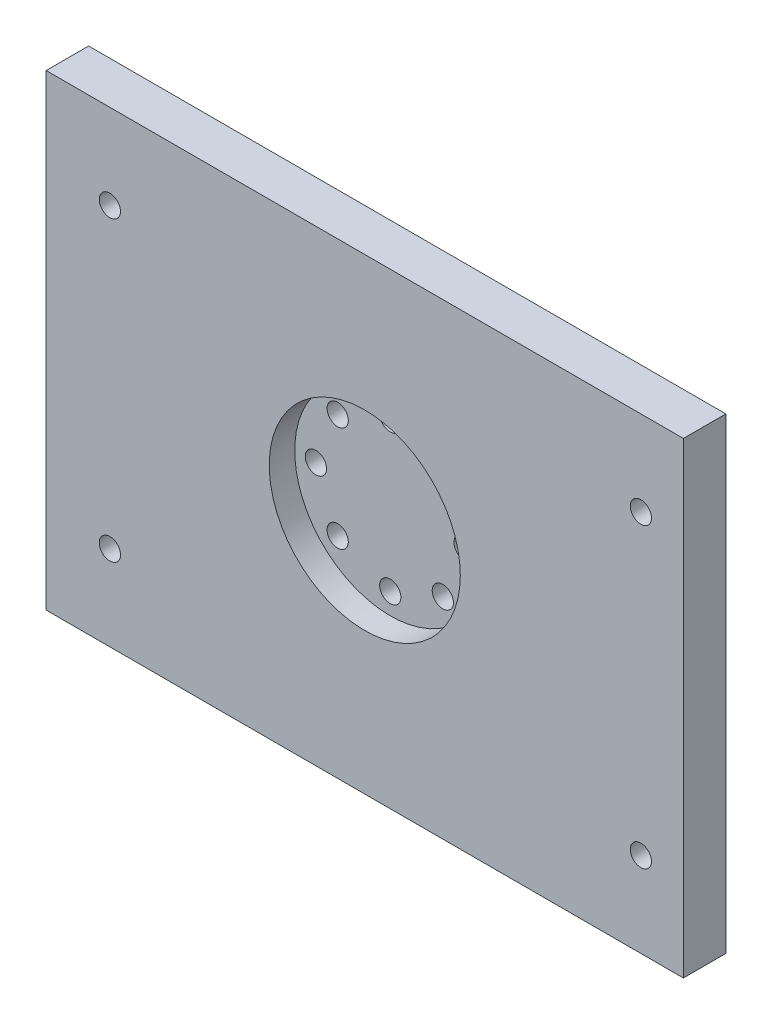
ISO-10303-21;
HEADER;
FILE_DESCRIPTION(('STEP AP214'),'2;1');
FILE_NAME('part.step','',(''),(''),'','','');
FILE_SCHEMA(('AUTOMOTIVE_DESIGN { 1 0 10303 214 1 1 1 1 }'));
ENDSEC;
DATA;
#1=APPLICATION_CONTEXT('core data for automotive mechanical design processes');
#2=APPLICATION_PROTOCOL_DEFINITION('international standard','automotive_design',2000,#1);
#3=PRODUCT_CONTEXT('',#1,'mechanical');
#4=PRODUCT('Part','Part','',(#3));
#5=PRODUCT_RELATED_PRODUCT_CATEGORY('part','',(#4));
#6=PRODUCT_DEFINITION_FORMATION('','',#4);
#7=PRODUCT_DEFINITION_CONTEXT('part definition',#1,'design');
#8=PRODUCT_DEFINITION('design','',#6,#7);
#9=PRODUCT_DEFINITION_SHAPE('','',#8);
#10=(LENGTH_UNIT() NAMED_UNIT(*) SI_UNIT(.MILLI.,.METRE.));
#11=(NAMED_UNIT(*) PLANE_ANGLE_UNIT() SI_UNIT($,.RADIAN.));
#12=(NAMED_UNIT(*) SI_UNIT($,.STERADIAN.) SOLID_ANGLE_UNIT());
#13=UNCERTAINTY_MEASURE_WITH_UNIT(LENGTH_MEASURE(1.E-05),#10,'distance_accuracy_value','');
#14=(GEOMETRIC_REPRESENTATION_CONTEXT(3) GLOBAL_UNCERTAINTY_ASSIGNED_CONTEXT((#13)) GLOBAL_UNIT_ASSIGNED_CONTEXT((#10,
#11,#12)) REPRESENTATION_CONTEXT('',''));
#15=CARTESIAN_POINT('',(0.,0.,0.));
#16=DIRECTION('',(0.,0.,1.));
#17=DIRECTION('',(1.,0.,0.));
#18=AXIS2_PLACEMENT_3D('',#15,#16,#17);
#19=CARTESIAN_POINT('',(-125.323383084577,54.1791044776119,10.));
#20=DIRECTION('',(1.,0.,0.));
#21=DIRECTION('',(0.,0.,-1.));
#22=AXIS2_PLACEMENT_3D('',#19,#20,#21);
#23=PLANE('',#22);
#24=DIRECTION('',(0.,-1.,0.));
#25=VECTOR('',#24,1.);
#26=CARTESIAN_POINT('',(-125.323383084577,54.1791044776119,0.));
#27=LINE('',#26,#25);
#28=CARTESIAN_POINT('',(-125.323383084577,54.1791044776119,0.));
#29=VERTEX_POINT('',#28);
#30=CARTESIAN_POINT('',(-125.323383084577,-55.8208955223881,0.));
#31=VERTEX_POINT('',#30);
#32=EDGE_CURVE('E96',#29,#31,#27,.T.);
#33=ORIENTED_EDGE('',*,*,#32,.T.);
#34=DIRECTION('',(0.,0.,-1.));
#35=VECTOR('',#34,1.);
#36=CARTESIAN_POINT('',(-125.323383084577,-55.8208955223881,10.));
#37=LINE('',#36,#35);
#38=CARTESIAN_POINT('',(-125.323383084577,-55.8208955223881,10.));
#39=VERTEX_POINT('',#38);
#40=EDGE_CURVE('E11',#39,#31,#37,.T.);
#41=ORIENTED_EDGE('',*,*,#40,.F.);
#42=DIRECTION('',(0.,-1.,0.));
#43=VECTOR('',#42,1.);
#44=CARTESIAN_POINT('',(-125.323383084577,54.1791044776119,10.));
#45=LINE('',#44,#43);
#46=CARTESIAN_POINT('',(-125.323383084577,54.1791044776119,10.));
#47=VERTEX_POINT('',#46);
#48=EDGE_CURVE('E84',#47,#39,#45,.T.);
#49=ORIENTED_EDGE('',*,*,#48,.F.);
#50=DIRECTION('',(0.,0.,-1.));
#51=VECTOR('',#50,1.);
#52=CARTESIAN_POINT('',(-125.323383084577,54.1791044776119,10.));
#53=LINE('',#52,#51);
#54=EDGE_CURVE('E92',#47,#29,#53,.T.);
#55=ORIENTED_EDGE('',*,*,#54,.T.);
#56=EDGE_LOOP('',(#33,#41,#49,#55));
#57=FACE_BOUND('',#56,.T.);
#58=ADVANCED_FACE('F33',(#57),#23,.F.);
#59=CARTESIAN_POINT('',(-125.323383084577,-55.8208955223881,10.));
#60=DIRECTION('',(0.,1.,0.));
#61=DIRECTION('',(0.,0.,1.));
#62=AXIS2_PLACEMENT_3D('',#59,#60,#61);
#63=PLANE('',#62);
#64=DIRECTION('',(1.,0.,0.));
#65=VECTOR('',#64,1.);
#66=CARTESIAN_POINT('',(-125.323383084577,-55.8208955223881,0.));
#67=LINE('',#66,#65);
#68=CARTESIAN_POINT('',(24.6766169154229,-55.8208955223881,0.));
#69=VERTEX_POINT('',#68);
#70=EDGE_CURVE('E88',#31,#69,#67,.T.);
#71=ORIENTED_EDGE('',*,*,#70,.T.);
#72=DIRECTION('',(0.,0.,-1.));
#73=VECTOR('',#72,1.);
#74=CARTESIAN_POINT('',(24.6766169154229,-55.8208955223881,10.));
#75=LINE('',#74,#73);
#76=CARTESIAN_POINT('',(24.6766169154229,-55.8208955223881,10.));
#77=VERTEX_POINT('',#76);
#78=EDGE_CURVE('E41',#77,#69,#75,.T.);
#79=ORIENTED_EDGE('',*,*,#78,.F.);
#80=DIRECTION('',(1.,0.,0.));
#81=VECTOR('',#80,1.);
#82=CARTESIAN_POINT('',(-125.323383084577,-55.8208955223881,10.));
#83=LINE('',#82,#81);
#84=EDGE_CURVE('E79',#39,#77,#83,.T.);
#85=ORIENTED_EDGE('',*,*,#84,.F.);
#86=ORIENTED_EDGE('',*,*,#40,.T.);
#87=EDGE_LOOP('',(#71,#79,#85,#86));
#88=FACE_BOUND('',#87,.T.);
#89=ADVANCED_FACE('F87',(#88),#63,.F.);
#90=CARTESIAN_POINT('',(24.6766169154228,54.1791044776119,10.));
#91=DIRECTION('',(-1.,0.,0.));
#92=DIRECTION('',(0.,-1.,0.));
#93=AXIS2_PLACEMENT_3D('',#90,#91,#92);
#94=PLANE('',#93);
#95=DIRECTION('',(0.,1.,0.));
#96=VECTOR('',#95,1.);
#97=CARTESIAN_POINT('',(24.6766169154228,54.1791044776119,0.));
#98=LINE('',#97,#96);
#99=CARTESIAN_POINT('',(24.6766169154228,54.1791044776119,0.));
#100=VERTEX_POINT('',#99);
#101=EDGE_CURVE('E66',#69,#100,#98,.T.);
#102=ORIENTED_EDGE('',*,*,#101,.T.);
#103=DIRECTION('',(0.,0.,-1.));
#104=VECTOR('',#103,1.);
#105=CARTESIAN_POINT('',(24.6766169154228,54.1791044776119,10.));
#106=LINE('',#105,#104);
#107=CARTESIAN_POINT('',(24.6766169154228,54.1791044776119,10.));
#108=VERTEX_POINT('',#107);
#109=EDGE_CURVE('E89',#108,#100,#106,.T.);
#110=ORIENTED_EDGE('',*,*,#109,.F.);
#111=DIRECTION('',(0.,1.,0.));
#112=VECTOR('',#111,1.);
#113=CARTESIAN_POINT('',(24.6766169154228,54.1791044776119,10.));
#114=LINE('',#113,#112);
#115=EDGE_CURVE('E82',#77,#108,#114,.T.);
#116=ORIENTED_EDGE('',*,*,#115,.F.);
#117=ORIENTED_EDGE('',*,*,#78,.T.);
#118=EDGE_LOOP('',(#102,#110,#116,#117));
#119=FACE_BOUND('',#118,.T.);
#120=ADVANCED_FACE('F90',(#119),#94,.F.);
#121=CARTESIAN_POINT('',(-125.323383084577,54.1791044776119,10.));
#122=DIRECTION('',(0.,-1.,0.));
#123=DIRECTION('',(0.,0.,-1.));
#124=AXIS2_PLACEMENT_3D('',#121,#122,#123);
#125=PLANE('',#124);
#126=DIRECTION('',(-1.,0.,0.));
#127=VECTOR('',#126,1.);
#128=CARTESIAN_POINT('',(-125.323383084577,54.1791044776119,0.));
#129=LINE('',#128,#127);
#130=EDGE_CURVE('E72',#100,#29,#129,.T.);
#131=ORIENTED_EDGE('',*,*,#130,.T.);
#132=ORIENTED_EDGE('',*,*,#54,.F.);
#133=DIRECTION('',(-1.,0.,0.));
#134=VECTOR('',#133,1.);
#135=CARTESIAN_POINT('',(-125.323383084577,54.1791044776119,10.));
#136=LINE('',#135,#134);
#137=EDGE_CURVE('E49',#108,#47,#136,.T.);
#138=ORIENTED_EDGE('',*,*,#137,.F.);
#139=ORIENTED_EDGE('',*,*,#109,.T.);
#140=EDGE_LOOP('',(#131,#132,#138,#139));
#141=FACE_BOUND('',#140,.T.);
#142=ADVANCED_FACE('F104',(#141),#125,.F.);
#143=CARTESIAN_POINT('',(0.,0.,10.));
#144=DIRECTION('',(0.,0.,1.));
#145=DIRECTION('',(1.,0.,0.));
#146=AXIS2_PLACEMENT_3D('',#143,#144,#145);
#147=PLANE('',#146);
#148=CARTESIAN_POINT('',(-110.323383084577,34.1791044776119,10.));
#149=DIRECTION('',(0.,0.,1.));
#150=DIRECTION('',(1.,0.,0.));
#151=AXIS2_PLACEMENT_3D('',#148,#149,#150);
#152=CIRCLE('',#151,2.49999999999999);
#153=CARTESIAN_POINT('',(-107.823383084577,34.1791044776119,10.));
#154=VERTEX_POINT('',#153);
#155=EDGE_CURVE('E184',#154,#154,#152,.T.);
#156=ORIENTED_EDGE('',*,*,#155,.F.);
#157=EDGE_LOOP('',(#156));
#158=FACE_BOUND('',#157,.T.);
#159=CARTESIAN_POINT('',(14.6766169154229,34.1791044776119,10.));
#160=DIRECTION('',(0.,0.,1.));
#161=DIRECTION('',(1.,0.,0.));
#162=AXIS2_PLACEMENT_3D('',#159,#160,#161);
#163=CIRCLE('',#162,2.49999999999999);
#164=CARTESIAN_POINT('',(17.1766169154228,34.1791044776119,10.));
#165=VERTEX_POINT('',#164);
#166=EDGE_CURVE('E178',#165,#165,#163,.T.);
#167=ORIENTED_EDGE('',*,*,#166,.F.);
#168=EDGE_LOOP('',(#167));
#169=FACE_BOUND('',#168,.T.);
#170=CARTESIAN_POINT('',(14.6766169154229,-35.8208955223881,10.));
#171=DIRECTION('',(0.,0.,1.));
#172=DIRECTION('',(1.,0.,0.));
#173=AXIS2_PLACEMENT_3D('',#170,#171,#172);
#174=CIRCLE('',#173,2.49999999999999);
#175=CARTESIAN_POINT('',(17.1766169154228,-35.8208955223881,10.));
#176=VERTEX_POINT('',#175);
#177=EDGE_CURVE('E172',#176,#176,#174,.T.);
#178=ORIENTED_EDGE('',*,*,#177,.F.);
#179=EDGE_LOOP('',(#178));
#180=FACE_BOUND('',#179,.T.);
#181=CARTESIAN_POINT('',(-110.323383084577,-35.8208955223881,10.));
#182=DIRECTION('',(0.,0.,1.));
#183=DIRECTION('',(1.,0.,0.));
#184=AXIS2_PLACEMENT_3D('',#181,#182,#183);
#185=CIRCLE('',#184,2.49999999999999);
#186=CARTESIAN_POINT('',(-107.823383084577,-35.8208955223881,10.));
#187=VERTEX_POINT('',#186);
#188=EDGE_CURVE('E166',#187,#187,#185,.T.);
#189=ORIENTED_EDGE('',*,*,#188,.F.);
#190=EDGE_LOOP('',(#189));
#191=FACE_BOUND('',#190,.T.);
#192=CARTESIAN_POINT('',(-50.3233830845772,0.,10.));
#193=DIRECTION('',(0.,0.,1.));
#194=DIRECTION('',(1.,0.,0.));
#195=AXIS2_PLACEMENT_3D('',#192,#193,#194);
#196=CIRCLE('',#195,22.49);
#197=CARTESIAN_POINT('',(-27.8333830845772,0.,10.));
#198=VERTEX_POINT('',#197);
#199=EDGE_CURVE('E110',#198,#198,#196,.T.);
#200=ORIENTED_EDGE('',*,*,#199,.F.);
#201=EDGE_LOOP('',(#200));
#202=FACE_BOUND('',#201,.T.);
#203=ORIENTED_EDGE('',*,*,#48,.T.);
#204=ORIENTED_EDGE('',*,*,#84,.T.);
#205=ORIENTED_EDGE('',*,*,#115,.T.);
#206=ORIENTED_EDGE('',*,*,#137,.T.);
#207=EDGE_LOOP('',(#203,#204,#205,#206));
#208=FACE_BOUND('',#207,.T.);
#209=ADVANCED_FACE('F80',(#158,#169,#180,#191,#202,#208),#147,.T.);
#210=CARTESIAN_POINT('',(0.,0.,0.));
#211=DIRECTION('',(0.,0.,1.));
#212=DIRECTION('',(1.,0.,0.));
#213=AXIS2_PLACEMENT_3D('',#210,#211,#212);
#214=PLANE('',#213);
#215=CARTESIAN_POINT('',(-110.323383084577,34.1791044776119,0.));
#216=DIRECTION('',(0.,0.,1.));
#217=DIRECTION('',(1.,0.,0.));
#218=AXIS2_PLACEMENT_3D('',#215,#216,#217);
#219=CIRCLE('',#218,2.5);
#220=CARTESIAN_POINT('',(-107.823383084577,34.1791044776119,0.));
#221=VERTEX_POINT('',#220);
#222=EDGE_CURVE('E181',#221,#221,#219,.T.);
#223=ORIENTED_EDGE('',*,*,#222,.T.);
#224=EDGE_LOOP('',(#223));
#225=FACE_BOUND('',#224,.T.);
#226=CARTESIAN_POINT('',(14.6766169154229,34.1791044776119,0.));
#227=DIRECTION('',(0.,0.,1.));
#228=DIRECTION('',(1.,0.,0.));
#229=AXIS2_PLACEMENT_3D('',#226,#227,#228);
#230=CIRCLE('',#229,2.5);
#231=CARTESIAN_POINT('',(17.1766169154229,34.1791044776119,0.));
#232=VERTEX_POINT('',#231);
#233=EDGE_CURVE('E175',#232,#232,#230,.T.);
#234=ORIENTED_EDGE('',*,*,#233,.T.);
#235=EDGE_LOOP('',(#234));
#236=FACE_BOUND('',#235,.T.);
#237=CARTESIAN_POINT('',(14.6766169154229,-35.8208955223881,0.));
#238=DIRECTION('',(0.,0.,1.));
#239=DIRECTION('',(1.,0.,0.));
#240=AXIS2_PLACEMENT_3D('',#237,#238,#239);
#241=CIRCLE('',#240,2.5);
#242=CARTESIAN_POINT('',(17.1766169154229,-35.8208955223881,0.));
#243=VERTEX_POINT('',#242);
#244=EDGE_CURVE('E169',#243,#243,#241,.T.);
#245=ORIENTED_EDGE('',*,*,#244,.T.);
#246=EDGE_LOOP('',(#245));
#247=FACE_BOUND('',#246,.T.);
#248=CARTESIAN_POINT('',(-110.323383084577,-35.8208955223881,0.));
#249=DIRECTION('',(0.,0.,1.));
#250=DIRECTION('',(1.,0.,0.));
#251=AXIS2_PLACEMENT_3D('',#248,#249,#250);
#252=CIRCLE('',#251,2.5);
#253=CARTESIAN_POINT('',(-107.823383084577,-35.8208955223881,0.));
#254=VERTEX_POINT('',#253);
#255=EDGE_CURVE('E163',#254,#254,#252,.T.);
#256=ORIENTED_EDGE('',*,*,#255,.T.);
#257=EDGE_LOOP('',(#256));
#258=FACE_BOUND('',#257,.T.);
#259=CARTESIAN_POINT('',(-50.3233830845772,17.5,0.));
#260=DIRECTION('',(0.,0.,1.));
#261=DIRECTION('',(1.,0.,0.));
#262=AXIS2_PLACEMENT_3D('',#259,#260,#261);
#263=CIRCLE('',#262,2.5);
#264=CARTESIAN_POINT('',(-47.8233830845772,17.5,0.));
#265=VERTEX_POINT('',#264);
#266=EDGE_CURVE('E157',#265,#265,#263,.T.);
#267=ORIENTED_EDGE('',*,*,#266,.T.);
#268=EDGE_LOOP('',(#267));
#269=FACE_BOUND('',#268,.T.);
#270=CARTESIAN_POINT('',(-62.6977517553417,12.3743686707646,0.));
#271=DIRECTION('',(0.,0.,1.));
#272=DIRECTION('',(1.,0.,0.));
#273=AXIS2_PLACEMENT_3D('',#270,#271,#272);
#274=CIRCLE('',#273,2.5);
#275=CARTESIAN_POINT('',(-60.1977517553417,12.3743686707646,0.));
#276=VERTEX_POINT('',#275);
#277=EDGE_CURVE('E151',#276,#276,#274,.T.);
#278=ORIENTED_EDGE('',*,*,#277,.T.);
#279=EDGE_LOOP('',(#278));
#280=FACE_BOUND('',#279,.T.);
#281=CARTESIAN_POINT('',(-67.8233830845772,0.,0.));
#282=DIRECTION('',(0.,0.,1.));
#283=DIRECTION('',(1.,0.,0.));
#284=AXIS2_PLACEMENT_3D('',#281,#282,#283);
#285=CIRCLE('',#284,2.5);
#286=CARTESIAN_POINT('',(-65.3233830845772,0.,0.));
#287=VERTEX_POINT('',#286);
#288=EDGE_CURVE('E145',#287,#287,#285,.T.);
#289=ORIENTED_EDGE('',*,*,#288,.T.);
#290=EDGE_LOOP('',(#289));
#291=FACE_BOUND('',#290,.T.);
#292=CARTESIAN_POINT('',(-62.6977517553417,-12.3743686707646,0.));
#293=DIRECTION('',(0.,0.,1.));
#294=DIRECTION('',(1.,0.,0.));
#295=AXIS2_PLACEMENT_3D('',#292,#293,#294);
#296=CIRCLE('',#295,2.5);
#297=CARTESIAN_POINT('',(-60.1977517553417,-12.3743686707646,0.));
#298=VERTEX_POINT('',#297);
#299=EDGE_CURVE('E139',#298,#298,#296,.T.);
#300=ORIENTED_EDGE('',*,*,#299,.T.);
#301=EDGE_LOOP('',(#300));
#302=FACE_BOUND('',#301,.T.);
#303=CARTESIAN_POINT('',(-50.3233830845772,-17.5,0.));
#304=DIRECTION('',(0.,0.,1.));
#305=DIRECTION('',(1.,0.,0.));
#306=AXIS2_PLACEMENT_3D('',#303,#304,#305);
#307=CIRCLE('',#306,2.5);
#308=CARTESIAN_POINT('',(-47.8233830845772,-17.5,0.));
#309=VERTEX_POINT('',#308);
#310=EDGE_CURVE('E133',#309,#309,#307,.T.);
#311=ORIENTED_EDGE('',*,*,#310,.T.);
#312=EDGE_LOOP('',(#311));
#313=FACE_BOUND('',#312,.T.);
#314=CARTESIAN_POINT('',(-37.9490144138126,-12.3743686707646,0.));
#315=DIRECTION('',(0.,0.,1.));
#316=DIRECTION('',(1.,0.,0.));
#317=AXIS2_PLACEMENT_3D('',#314,#315,#316);
#318=CIRCLE('',#317,2.5);
#319=CARTESIAN_POINT('',(-35.4490144138126,-12.3743686707646,0.));
#320=VERTEX_POINT('',#319);
#321=EDGE_CURVE('E127',#320,#320,#318,.T.);
#322=ORIENTED_EDGE('',*,*,#321,.T.);
#323=EDGE_LOOP('',(#322));
#324=FACE_BOUND('',#323,.T.);
#325=CARTESIAN_POINT('',(-32.8233830845772,0.,0.));
#326=DIRECTION('',(0.,0.,1.));
#327=DIRECTION('',(1.,0.,0.));
#328=AXIS2_PLACEMENT_3D('',#325,#326,#327);
#329=CIRCLE('',#328,2.5);
#330=CARTESIAN_POINT('',(-30.3233830845772,0.,0.));
#331=VERTEX_POINT('',#330);
#332=EDGE_CURVE('E121',#331,#331,#329,.T.);
#333=ORIENTED_EDGE('',*,*,#332,.T.);
#334=EDGE_LOOP('',(#333));
#335=FACE_BOUND('',#334,.T.);
#336=CARTESIAN_POINT('',(-37.9490144138126,12.3743686707646,0.));
#337=DIRECTION('',(0.,0.,1.));
#338=DIRECTION('',(1.,0.,0.));
#339=AXIS2_PLACEMENT_3D('',#336,#337,#338);
#340=CIRCLE('',#339,2.5);
#341=CARTESIAN_POINT('',(-35.4490144138126,12.3743686707646,0.));
#342=VERTEX_POINT('',#341);
#343=EDGE_CURVE('E113',#342,#342,#340,.T.);
#344=ORIENTED_EDGE('',*,*,#343,.T.);
#345=EDGE_LOOP('',(#344));
#346=FACE_BOUND('',#345,.T.);
#347=ORIENTED_EDGE('',*,*,#32,.F.);
#348=ORIENTED_EDGE('',*,*,#130,.F.);
#349=ORIENTED_EDGE('',*,*,#101,.F.);
#350=ORIENTED_EDGE('',*,*,#70,.F.);
#351=EDGE_LOOP('',(#347,#348,#349,#350));
#352=FACE_BOUND('',#351,.T.);
#353=ADVANCED_FACE('F107',(#225,#236,#247,#258,#269,#280,#291,#302,#313,#324,#335,#346,#352),
#214,.F.);
#354=CARTESIAN_POINT('',(-50.3233830845772,0.,4.));
#355=DIRECTION('',(0.,0.,1.));
#356=DIRECTION('',(1.,0.,0.));
#357=AXIS2_PLACEMENT_3D('',#354,#355,#356);
#358=CYLINDRICAL_SURFACE('',#357,22.49);
#359=CARTESIAN_POINT('',(-50.3233830845772,0.,4.));
#360=DIRECTION('',(0.,0.,1.));
#361=DIRECTION('',(1.,0.,0.));
#362=AXIS2_PLACEMENT_3D('',#359,#360,#361);
#363=CIRCLE('',#362,22.49);
#364=CARTESIAN_POINT('',(-27.8333830845772,0.,4.));
#365=VERTEX_POINT('',#364);
#366=EDGE_CURVE('E99',#365,#365,#363,.T.);
#367=ORIENTED_EDGE('',*,*,#366,.F.);
#368=EDGE_LOOP('',(#367));
#369=FACE_BOUND('',#368,.T.);
#370=ORIENTED_EDGE('',*,*,#199,.T.);
#371=EDGE_LOOP('',(#370));
#372=FACE_BOUND('',#371,.T.);
#373=ADVANCED_FACE('F201',(#369,#372),#358,.F.);
#374=CARTESIAN_POINT('',(-50.3233830845772,0.,4.));
#375=DIRECTION('',(0.,0.,1.));
#376=DIRECTION('',(1.,0.,0.));
#377=AXIS2_PLACEMENT_3D('',#374,#375,#376);
#378=PLANE('',#377);
#379=CARTESIAN_POINT('',(-50.3233830845772,17.5,4.));
#380=DIRECTION('',(0.,0.,1.));
#381=DIRECTION('',(1.,0.,0.));
#382=AXIS2_PLACEMENT_3D('',#379,#380,#381);
#383=CIRCLE('',#382,2.49999999999999);
#384=CARTESIAN_POINT('',(-47.8233830845772,17.5,4.));
#385=VERTEX_POINT('',#384);
#386=EDGE_CURVE('E160',#385,#385,#383,.T.);
#387=ORIENTED_EDGE('',*,*,#386,.F.);
#388=EDGE_LOOP('',(#387));
#389=FACE_BOUND('',#388,.T.);
#390=CARTESIAN_POINT('',(-62.6977517553417,12.3743686707646,4.));
#391=DIRECTION('',(0.,0.,1.));
#392=DIRECTION('',(1.,0.,0.));
#393=AXIS2_PLACEMENT_3D('',#390,#391,#392);
#394=CIRCLE('',#393,2.49999999999999);
#395=CARTESIAN_POINT('',(-60.1977517553418,12.3743686707646,4.));
#396=VERTEX_POINT('',#395);
#397=EDGE_CURVE('E154',#396,#396,#394,.T.);
#398=ORIENTED_EDGE('',*,*,#397,.F.);
#399=EDGE_LOOP('',(#398));
#400=FACE_BOUND('',#399,.T.);
#401=CARTESIAN_POINT('',(-67.8233830845772,0.,4.));
#402=DIRECTION('',(0.,0.,1.));
#403=DIRECTION('',(1.,0.,0.));
#404=AXIS2_PLACEMENT_3D('',#401,#402,#403);
#405=CIRCLE('',#404,2.49999999999999);
#406=CARTESIAN_POINT('',(-65.3233830845772,0.,4.));
#407=VERTEX_POINT('',#406);
#408=EDGE_CURVE('E148',#407,#407,#405,.T.);
#409=ORIENTED_EDGE('',*,*,#408,.F.);
#410=EDGE_LOOP('',(#409));
#411=FACE_BOUND('',#410,.T.);
#412=CARTESIAN_POINT('',(-62.6977517553417,-12.3743686707646,4.));
#413=DIRECTION('',(0.,0.,1.));
#414=DIRECTION('',(1.,0.,0.));
#415=AXIS2_PLACEMENT_3D('',#412,#413,#414);
#416=CIRCLE('',#415,2.49999999999999);
#417=CARTESIAN_POINT('',(-60.1977517553418,-12.3743686707646,4.));
#418=VERTEX_POINT('',#417);
#419=EDGE_CURVE('E142',#418,#418,#416,.T.);
#420=ORIENTED_EDGE('',*,*,#419,.F.);
#421=EDGE_LOOP('',(#420));
#422=FACE_BOUND('',#421,.T.);
#423=CARTESIAN_POINT('',(-50.3233830845772,-17.5,4.));
#424=DIRECTION('',(0.,0.,1.));
#425=DIRECTION('',(1.,0.,0.));
#426=AXIS2_PLACEMENT_3D('',#423,#424,#425);
#427=CIRCLE('',#426,2.49999999999999);
#428=CARTESIAN_POINT('',(-47.8233830845772,-17.5,4.));
#429=VERTEX_POINT('',#428);
#430=EDGE_CURVE('E136',#429,#429,#427,.T.);
#431=ORIENTED_EDGE('',*,*,#430,.F.);
#432=EDGE_LOOP('',(#431));
#433=FACE_BOUND('',#432,.T.);
#434=CARTESIAN_POINT('',(-37.9490144138126,-12.3743686707646,4.));
#435=DIRECTION('',(0.,0.,1.));
#436=DIRECTION('',(1.,0.,0.));
#437=AXIS2_PLACEMENT_3D('',#434,#435,#436);
#438=CIRCLE('',#437,2.49999999999999);
#439=CARTESIAN_POINT('',(-35.4490144138126,-12.3743686707646,4.));
#440=VERTEX_POINT('',#439);
#441=EDGE_CURVE('E130',#440,#440,#438,.T.);
#442=ORIENTED_EDGE('',*,*,#441,.F.);
#443=EDGE_LOOP('',(#442));
#444=FACE_BOUND('',#443,.T.);
#445=CARTESIAN_POINT('',(-32.8233830845772,0.,4.));
#446=DIRECTION('',(0.,0.,1.));
#447=DIRECTION('',(1.,0.,0.));
#448=AXIS2_PLACEMENT_3D('',#445,#446,#447);
#449=CIRCLE('',#448,2.49999999999999);
#450=CARTESIAN_POINT('',(-30.3233830845772,0.,4.));
#451=VERTEX_POINT('',#450);
#452=EDGE_CURVE('E124',#451,#451,#449,.T.);
#453=ORIENTED_EDGE('',*,*,#452,.F.);
#454=EDGE_LOOP('',(#453));
#455=FACE_BOUND('',#454,.T.);
#456=CARTESIAN_POINT('',(-37.9490144138126,12.3743686707646,4.));
#457=DIRECTION('',(0.,0.,1.));
#458=DIRECTION('',(1.,0.,0.));
#459=AXIS2_PLACEMENT_3D('',#456,#457,#458);
#460=CIRCLE('',#459,2.49999999999999);
#461=CARTESIAN_POINT('',(-35.4490144138126,12.3743686707646,4.));
#462=VERTEX_POINT('',#461);
#463=EDGE_CURVE('E118',#462,#462,#460,.T.);
#464=ORIENTED_EDGE('',*,*,#463,.F.);
#465=EDGE_LOOP('',(#464));
#466=FACE_BOUND('',#465,.T.);
#467=ORIENTED_EDGE('',*,*,#366,.T.);
#468=EDGE_LOOP('',(#467));
#469=FACE_BOUND('',#468,.T.);
#470=ADVANCED_FACE('F203',(#389,#400,#411,#422,#433,#444,#455,#466,#469),#378,.T.);
#471=CARTESIAN_POINT('',(-37.9490144138126,12.3743686707646,4.));
#472=DIRECTION('',(0.,0.,1.));
#473=DIRECTION('',(1.,0.,0.));
#474=AXIS2_PLACEMENT_3D('',#471,#472,#473);
#475=CYLINDRICAL_SURFACE('',#474,2.5);
#476=ORIENTED_EDGE('',*,*,#343,.F.);
#477=EDGE_LOOP('',(#476));
#478=FACE_BOUND('',#477,.T.);
#479=ORIENTED_EDGE('',*,*,#463,.T.);
#480=EDGE_LOOP('',(#479));
#481=FACE_BOUND('',#480,.T.);
#482=ADVANCED_FACE('F210',(#478,#481),#475,.F.);
#483=CARTESIAN_POINT('',(-32.8233830845772,0.,4.));
#484=DIRECTION('',(0.,0.,1.));
#485=DIRECTION('',(1.,0.,0.));
#486=AXIS2_PLACEMENT_3D('',#483,#484,#485);
#487=CYLINDRICAL_SURFACE('',#486,2.49999999999999);
#488=ORIENTED_EDGE('',*,*,#332,.F.);
#489=EDGE_LOOP('',(#488));
#490=FACE_BOUND('',#489,.T.);
#491=ORIENTED_EDGE('',*,*,#452,.T.);
#492=EDGE_LOOP('',(#491));
#493=FACE_BOUND('',#492,.T.);
#494=ADVANCED_FACE('F309',(#490,#493),#487,.F.);
#495=CARTESIAN_POINT('',(-37.9490144138126,-12.3743686707646,4.));
#496=DIRECTION('',(0.,0.,1.));
#497=DIRECTION('',(1.,0.,0.));
#498=AXIS2_PLACEMENT_3D('',#495,#496,#497);
#499=CYLINDRICAL_SURFACE('',#498,2.5);
#500=ORIENTED_EDGE('',*,*,#321,.F.);
#501=EDGE_LOOP('',(#500));
#502=FACE_BOUND('',#501,.T.);
#503=ORIENTED_EDGE('',*,*,#441,.T.);
#504=EDGE_LOOP('',(#503));
#505=FACE_BOUND('',#504,.T.);
#506=ADVANCED_FACE('F305',(#502,#505),#499,.F.);
#507=CARTESIAN_POINT('',(-50.3233830845772,-17.5,4.));
#508=DIRECTION('',(0.,0.,1.));
#509=DIRECTION('',(1.,0.,0.));
#510=AXIS2_PLACEMENT_3D('',#507,#508,#509);
#511=CYLINDRICAL_SURFACE('',#510,2.5);
#512=ORIENTED_EDGE('',*,*,#310,.F.);
#513=EDGE_LOOP('',(#512));
#514=FACE_BOUND('',#513,.T.);
#515=ORIENTED_EDGE('',*,*,#430,.T.);
#516=EDGE_LOOP('',(#515));
#517=FACE_BOUND('',#516,.T.);
#518=ADVANCED_FACE('F301',(#514,#517),#511,.F.);
#519=CARTESIAN_POINT('',(-62.6977517553417,-12.3743686707646,4.));
#520=DIRECTION('',(0.,0.,1.));
#521=DIRECTION('',(1.,0.,0.));
#522=AXIS2_PLACEMENT_3D('',#519,#520,#521);
#523=CYLINDRICAL_SURFACE('',#522,2.5);
#524=ORIENTED_EDGE('',*,*,#299,.F.);
#525=EDGE_LOOP('',(#524));
#526=FACE_BOUND('',#525,.T.);
#527=ORIENTED_EDGE('',*,*,#419,.T.);
#528=EDGE_LOOP('',(#527));
#529=FACE_BOUND('',#528,.T.);
#530=ADVANCED_FACE('F297',(#526,#529),#523,.F.);
#531=CARTESIAN_POINT('',(-67.8233830845772,0.,4.));
#532=DIRECTION('',(0.,0.,1.));
#533=DIRECTION('',(1.,0.,0.));
#534=AXIS2_PLACEMENT_3D('',#531,#532,#533);
#535=CYLINDRICAL_SURFACE('',#534,2.5);
#536=ORIENTED_EDGE('',*,*,#288,.F.);
#537=EDGE_LOOP('',(#536));
#538=FACE_BOUND('',#537,.T.);
#539=ORIENTED_EDGE('',*,*,#408,.T.);
#540=EDGE_LOOP('',(#539));
#541=FACE_BOUND('',#540,.T.);
#542=ADVANCED_FACE('F293',(#538,#541),#535,.F.);
#543=CARTESIAN_POINT('',(-62.6977517553417,12.3743686707646,4.));
#544=DIRECTION('',(0.,0.,1.));
#545=DIRECTION('',(1.,0.,0.));
#546=AXIS2_PLACEMENT_3D('',#543,#544,#545);
#547=CYLINDRICAL_SURFACE('',#546,2.5);
#548=ORIENTED_EDGE('',*,*,#277,.F.);
#549=EDGE_LOOP('',(#548));
#550=FACE_BOUND('',#549,.T.);
#551=ORIENTED_EDGE('',*,*,#397,.T.);
#552=EDGE_LOOP('',(#551));
#553=FACE_BOUND('',#552,.T.);
#554=ADVANCED_FACE('F289',(#550,#553),#547,.F.);
#555=CARTESIAN_POINT('',(-50.3233830845772,17.5,4.));
#556=DIRECTION('',(0.,0.,1.));
#557=DIRECTION('',(1.,0.,0.));
#558=AXIS2_PLACEMENT_3D('',#555,#556,#557);
#559=CYLINDRICAL_SURFACE('',#558,2.5);
#560=ORIENTED_EDGE('',*,*,#266,.F.);
#561=EDGE_LOOP('',(#560));
#562=FACE_BOUND('',#561,.T.);
#563=ORIENTED_EDGE('',*,*,#386,.T.);
#564=EDGE_LOOP('',(#563));
#565=FACE_BOUND('',#564,.T.);
#566=ADVANCED_FACE('F251',(#562,#565),#559,.F.);
#567=CARTESIAN_POINT('',(-110.323383084577,-35.8208955223881,10.));
#568=DIRECTION('',(0.,0.,1.));
#569=DIRECTION('',(1.,0.,0.));
#570=AXIS2_PLACEMENT_3D('',#567,#568,#569);
#571=CYLINDRICAL_SURFACE('',#570,2.5);
#572=ORIENTED_EDGE('',*,*,#255,.F.);
#573=EDGE_LOOP('',(#572));
#574=FACE_BOUND('',#573,.T.);
#575=ORIENTED_EDGE('',*,*,#188,.T.);
#576=EDGE_LOOP('',(#575));
#577=FACE_BOUND('',#576,.T.);
#578=ADVANCED_FACE('F245',(#574,#577),#571,.F.);
#579=CARTESIAN_POINT('',(14.6766169154229,-35.8208955223881,10.));
#580=DIRECTION('',(0.,0.,1.));
#581=DIRECTION('',(1.,0.,0.));
#582=AXIS2_PLACEMENT_3D('',#579,#580,#581);
#583=CYLINDRICAL_SURFACE('',#582,2.49999999999999);
#584=ORIENTED_EDGE('',*,*,#244,.F.);
#585=EDGE_LOOP('',(#584));
#586=FACE_BOUND('',#585,.T.);
#587=ORIENTED_EDGE('',*,*,#177,.T.);
#588=EDGE_LOOP('',(#587));
#589=FACE_BOUND('',#588,.T.);
#590=ADVANCED_FACE('F250',(#586,#589),#583,.F.);
#591=CARTESIAN_POINT('',(14.6766169154229,34.1791044776119,10.));
#592=DIRECTION('',(0.,0.,1.));
#593=DIRECTION('',(1.,0.,0.));
#594=AXIS2_PLACEMENT_3D('',#591,#592,#593);
#595=CYLINDRICAL_SURFACE('',#594,2.49999999999999);
#596=ORIENTED_EDGE('',*,*,#233,.F.);
#597=EDGE_LOOP('',(#596));
#598=FACE_BOUND('',#597,.T.);
#599=ORIENTED_EDGE('',*,*,#166,.T.);
#600=EDGE_LOOP('',(#599));
#601=FACE_BOUND('',#600,.T.);
#602=ADVANCED_FACE('F263',(#598,#601),#595,.F.);
#603=CARTESIAN_POINT('',(-110.323383084577,34.1791044776119,10.));
#604=DIRECTION('',(0.,0.,1.));
#605=DIRECTION('',(1.,0.,0.));
#606=AXIS2_PLACEMENT_3D('',#603,#604,#605);
#607=CYLINDRICAL_SURFACE('',#606,2.5);
#608=ORIENTED_EDGE('',*,*,#222,.F.);
#609=EDGE_LOOP('',(#608));
#610=FACE_BOUND('',#609,.T.);
#611=ORIENTED_EDGE('',*,*,#155,.T.);
#612=EDGE_LOOP('',(#611));
#613=FACE_BOUND('',#612,.T.);
#614=ADVANCED_FACE('F188',(#610,#613),#607,.F.);
#615=CLOSED_SHELL('',(#58,#89,#120,#142,#209,#353,#373,#470,#482,#494,#506,#518,#530,#542,#554,
#566,#578,#590,#602,#614));
#616=MANIFOLD_SOLID_BREP('B2',#615);
#617=ADVANCED_BREP_SHAPE_REPRESENTATION('',(#18,#616),#14);
#618=SHAPE_DEFINITION_REPRESENTATION(#9,#617);
ENDSEC;
END-ISO-10303-21;
